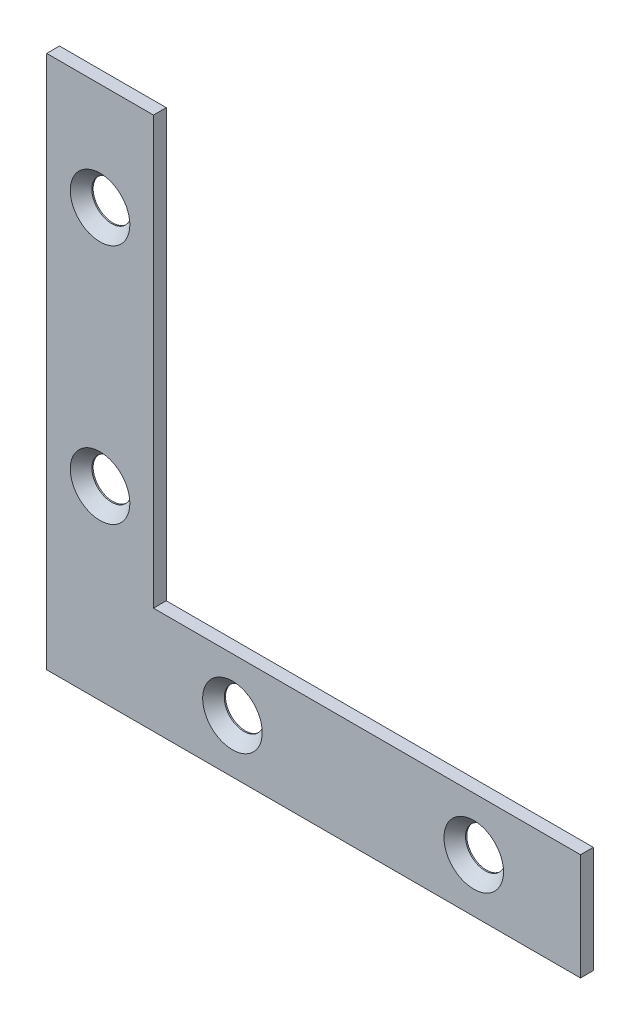
ISO-10303-21;
HEADER;
FILE_DESCRIPTION(('STEP AP214'),'2;1');
FILE_NAME('part.step','',(''),(''),'','','');
FILE_SCHEMA(('AUTOMOTIVE_DESIGN { 1 0 10303 214 1 1 1 1 }'));
ENDSEC;
DATA;
#1=APPLICATION_CONTEXT('core data for automotive mechanical design processes');
#2=APPLICATION_PROTOCOL_DEFINITION('international standard','automotive_design',2000,#1);
#3=PRODUCT_CONTEXT('',#1,'mechanical');
#4=PRODUCT('Part','Part','',(#3));
#5=PRODUCT_RELATED_PRODUCT_CATEGORY('part','',(#4));
#6=PRODUCT_DEFINITION_FORMATION('','',#4);
#7=PRODUCT_DEFINITION_CONTEXT('part definition',#1,'design');
#8=PRODUCT_DEFINITION('design','',#6,#7);
#9=PRODUCT_DEFINITION_SHAPE('','',#8);
#10=(LENGTH_UNIT() NAMED_UNIT(*) SI_UNIT(.MILLI.,.METRE.));
#11=(NAMED_UNIT(*) PLANE_ANGLE_UNIT() SI_UNIT($,.RADIAN.));
#12=(NAMED_UNIT(*) SI_UNIT($,.STERADIAN.) SOLID_ANGLE_UNIT());
#13=UNCERTAINTY_MEASURE_WITH_UNIT(LENGTH_MEASURE(1.E-05),#10,'distance_accuracy_value','');
#14=(GEOMETRIC_REPRESENTATION_CONTEXT(3) GLOBAL_UNCERTAINTY_ASSIGNED_CONTEXT((#13)) GLOBAL_UNIT_ASSIGNED_CONTEXT((#10,
#11,#12)) REPRESENTATION_CONTEXT('',''));
#15=CARTESIAN_POINT('',(0.,0.,0.));
#16=DIRECTION('',(0.,0.,1.));
#17=DIRECTION('',(1.,0.,0.));
#18=AXIS2_PLACEMENT_3D('',#15,#16,#17);
#19=CARTESIAN_POINT('',(-31.75,-31.75,0.762));
#20=DIRECTION('',(1.,0.,0.));
#21=DIRECTION('',(0.,1.,0.));
#22=AXIS2_PLACEMENT_3D('',#19,#20,#21);
#23=PLANE('',#22);
#24=DIRECTION('',(0.,0.,-1.));
#25=VECTOR('',#24,1.);
#26=CARTESIAN_POINT('',(-31.75,31.75,0.762));
#27=LINE('',#26,#25);
#28=CARTESIAN_POINT('',(-31.75,31.75,0.762));
#29=VERTEX_POINT('',#28);
#30=CARTESIAN_POINT('',(-31.75,31.75,-0.762));
#31=VERTEX_POINT('',#30);
#32=EDGE_CURVE('E109',#29,#31,#27,.T.);
#33=ORIENTED_EDGE('',*,*,#32,.T.);
#34=DIRECTION('',(0.,-1.,0.));
#35=VECTOR('',#34,1.);
#36=CARTESIAN_POINT('',(-31.75,-31.75,-0.762));
#37=LINE('',#36,#35);
#38=CARTESIAN_POINT('',(-31.75,-31.75,-0.762));
#39=VERTEX_POINT('',#38);
#40=EDGE_CURVE('E103',#31,#39,#37,.T.);
#41=ORIENTED_EDGE('',*,*,#40,.T.);
#42=DIRECTION('',(0.,0.,-1.));
#43=VECTOR('',#42,1.);
#44=CARTESIAN_POINT('',(-31.75,-31.75,0.762));
#45=LINE('',#44,#43);
#46=CARTESIAN_POINT('',(-31.75,-31.75,0.762));
#47=VERTEX_POINT('',#46);
#48=EDGE_CURVE('E11',#47,#39,#45,.T.);
#49=ORIENTED_EDGE('',*,*,#48,.F.);
#50=DIRECTION('',(0.,-1.,0.));
#51=VECTOR('',#50,1.);
#52=CARTESIAN_POINT('',(-31.75,-31.75,0.762));
#53=LINE('',#52,#51);
#54=EDGE_CURVE('E128',#29,#47,#53,.T.);
#55=ORIENTED_EDGE('',*,*,#54,.F.);
#56=EDGE_LOOP('',(#33,#41,#49,#55));
#57=FACE_BOUND('',#56,.T.);
#58=ADVANCED_FACE('F37',(#57),#23,.F.);
#59=CARTESIAN_POINT('',(31.75,-31.75,0.762));
#60=DIRECTION('',(0.,1.,0.));
#61=DIRECTION('',(0.,0.,1.));
#62=AXIS2_PLACEMENT_3D('',#59,#60,#61);
#63=PLANE('',#62);
#64=ORIENTED_EDGE('',*,*,#48,.T.);
#65=DIRECTION('',(1.,0.,0.));
#66=VECTOR('',#65,1.);
#67=CARTESIAN_POINT('',(31.75,-31.75,-0.762));
#68=LINE('',#67,#66);
#69=CARTESIAN_POINT('',(31.75,-31.75,-0.762));
#70=VERTEX_POINT('',#69);
#71=EDGE_CURVE('E93',#39,#70,#68,.T.);
#72=ORIENTED_EDGE('',*,*,#71,.T.);
#73=DIRECTION('',(0.,0.,-1.));
#74=VECTOR('',#73,1.);
#75=CARTESIAN_POINT('',(31.75,-31.75,0.762));
#76=LINE('',#75,#74);
#77=CARTESIAN_POINT('',(31.75,-31.75,0.762));
#78=VERTEX_POINT('',#77);
#79=EDGE_CURVE('E45',#78,#70,#76,.T.);
#80=ORIENTED_EDGE('',*,*,#79,.F.);
#81=DIRECTION('',(1.,0.,0.));
#82=VECTOR('',#81,1.);
#83=CARTESIAN_POINT('',(31.75,-31.75,0.762));
#84=LINE('',#83,#82);
#85=EDGE_CURVE('E94',#47,#78,#84,.T.);
#86=ORIENTED_EDGE('',*,*,#85,.F.);
#87=EDGE_LOOP('',(#64,#72,#80,#86));
#88=FACE_BOUND('',#87,.T.);
#89=ADVANCED_FACE('F91',(#88),#63,.F.);
#90=CARTESIAN_POINT('',(31.75,-19.05,0.762));
#91=DIRECTION('',(-1.,0.,0.));
#92=DIRECTION('',(0.,0.,1.));
#93=AXIS2_PLACEMENT_3D('',#90,#91,#92);
#94=PLANE('',#93);
#95=ORIENTED_EDGE('',*,*,#79,.T.);
#96=DIRECTION('',(0.,1.,0.));
#97=VECTOR('',#96,1.);
#98=CARTESIAN_POINT('',(31.75,-19.05,-0.762));
#99=LINE('',#98,#97);
#100=CARTESIAN_POINT('',(31.75,-19.05,-0.762));
#101=VERTEX_POINT('',#100);
#102=EDGE_CURVE('E107',#70,#101,#99,.T.);
#103=ORIENTED_EDGE('',*,*,#102,.T.);
#104=DIRECTION('',(0.,0.,-1.));
#105=VECTOR('',#104,1.);
#106=CARTESIAN_POINT('',(31.75,-19.05,0.762));
#107=LINE('',#106,#105);
#108=CARTESIAN_POINT('',(31.75,-19.05,0.762));
#109=VERTEX_POINT('',#108);
#110=EDGE_CURVE('E142',#109,#101,#107,.T.);
#111=ORIENTED_EDGE('',*,*,#110,.F.);
#112=DIRECTION('',(0.,1.,0.));
#113=VECTOR('',#112,1.);
#114=CARTESIAN_POINT('',(31.75,-19.05,0.762));
#115=LINE('',#114,#113);
#116=EDGE_CURVE('E131',#78,#109,#115,.T.);
#117=ORIENTED_EDGE('',*,*,#116,.F.);
#118=EDGE_LOOP('',(#95,#103,#111,#117));
#119=FACE_BOUND('',#118,.T.);
#120=ADVANCED_FACE('F196',(#119),#94,.F.);
#121=CARTESIAN_POINT('',(-19.05,-19.05,0.762));
#122=DIRECTION('',(0.,-1.,0.));
#123=DIRECTION('',(1.,0.,0.));
#124=AXIS2_PLACEMENT_3D('',#121,#122,#123);
#125=PLANE('',#124);
#126=ORIENTED_EDGE('',*,*,#110,.T.);
#127=DIRECTION('',(-1.,0.,0.));
#128=VECTOR('',#127,1.);
#129=CARTESIAN_POINT('',(-19.05,-19.05,-0.762));
#130=LINE('',#129,#128);
#131=CARTESIAN_POINT('',(-19.05,-19.05,-0.762));
#132=VERTEX_POINT('',#131);
#133=EDGE_CURVE('E120',#101,#132,#130,.T.);
#134=ORIENTED_EDGE('',*,*,#133,.T.);
#135=DIRECTION('',(0.,0.,-1.));
#136=VECTOR('',#135,1.);
#137=CARTESIAN_POINT('',(-19.05,-19.05,0.762));
#138=LINE('',#137,#136);
#139=CARTESIAN_POINT('',(-19.05,-19.05,0.762));
#140=VERTEX_POINT('',#139);
#141=EDGE_CURVE('E140',#140,#132,#138,.T.);
#142=ORIENTED_EDGE('',*,*,#141,.F.);
#143=DIRECTION('',(-1.,0.,0.));
#144=VECTOR('',#143,1.);
#145=CARTESIAN_POINT('',(-19.05,-19.05,0.762));
#146=LINE('',#145,#144);
#147=EDGE_CURVE('E133',#109,#140,#146,.T.);
#148=ORIENTED_EDGE('',*,*,#147,.F.);
#149=EDGE_LOOP('',(#126,#134,#142,#148));
#150=FACE_BOUND('',#149,.T.);
#151=ADVANCED_FACE('F200',(#150),#125,.F.);
#152=CARTESIAN_POINT('',(-19.05,31.75,0.762));
#153=DIRECTION('',(-1.,0.,0.));
#154=DIRECTION('',(0.,-1.,0.));
#155=AXIS2_PLACEMENT_3D('',#152,#153,#154);
#156=PLANE('',#155);
#157=ORIENTED_EDGE('',*,*,#141,.T.);
#158=DIRECTION('',(0.,1.,0.));
#159=VECTOR('',#158,1.);
#160=CARTESIAN_POINT('',(-19.05,31.75,-0.762));
#161=LINE('',#160,#159);
#162=CARTESIAN_POINT('',(-19.05,31.75,-0.762));
#163=VERTEX_POINT('',#162);
#164=EDGE_CURVE('E123',#132,#163,#161,.T.);
#165=ORIENTED_EDGE('',*,*,#164,.T.);
#166=DIRECTION('',(0.,0.,-1.));
#167=VECTOR('',#166,1.);
#168=CARTESIAN_POINT('',(-19.05,31.75,0.762));
#169=LINE('',#168,#167);
#170=CARTESIAN_POINT('',(-19.05,31.75,0.762));
#171=VERTEX_POINT('',#170);
#172=EDGE_CURVE('E138',#171,#163,#169,.T.);
#173=ORIENTED_EDGE('',*,*,#172,.F.);
#174=DIRECTION('',(0.,1.,0.));
#175=VECTOR('',#174,1.);
#176=CARTESIAN_POINT('',(-19.05,31.75,0.762));
#177=LINE('',#176,#175);
#178=EDGE_CURVE('E58',#140,#171,#177,.T.);
#179=ORIENTED_EDGE('',*,*,#178,.F.);
#180=EDGE_LOOP('',(#157,#165,#173,#179));
#181=FACE_BOUND('',#180,.T.);
#182=ADVANCED_FACE('F203',(#181),#156,.F.);
#183=CARTESIAN_POINT('',(-31.75,31.75,0.762));
#184=DIRECTION('',(0.,-1.,0.));
#185=DIRECTION('',(1.,0.,0.));
#186=AXIS2_PLACEMENT_3D('',#183,#184,#185);
#187=PLANE('',#186);
#188=ORIENTED_EDGE('',*,*,#172,.T.);
#189=DIRECTION('',(-1.,0.,0.));
#190=VECTOR('',#189,1.);
#191=CARTESIAN_POINT('',(-31.75,31.75,-0.762));
#192=LINE('',#191,#190);
#193=EDGE_CURVE('E126',#163,#31,#192,.T.);
#194=ORIENTED_EDGE('',*,*,#193,.T.);
#195=ORIENTED_EDGE('',*,*,#32,.F.);
#196=DIRECTION('',(-1.,0.,0.));
#197=VECTOR('',#196,1.);
#198=CARTESIAN_POINT('',(-31.75,31.75,0.762));
#199=LINE('',#198,#197);
#200=EDGE_CURVE('E53',#171,#29,#199,.T.);
#201=ORIENTED_EDGE('',*,*,#200,.F.);
#202=EDGE_LOOP('',(#188,#194,#195,#201));
#203=FACE_BOUND('',#202,.T.);
#204=ADVANCED_FACE('F186',(#203),#187,.F.);
#205=CARTESIAN_POINT('',(0.,0.,0.762));
#206=DIRECTION('',(0.,0.,-1.));
#207=DIRECTION('',(-1.,0.,0.));
#208=AXIS2_PLACEMENT_3D('',#205,#206,#207);
#209=PLANE('',#208);
#210=CARTESIAN_POINT('',(-25.4,19.05,0.762));
#211=DIRECTION('',(0.,0.,1.));
#212=DIRECTION('',(1.,0.,0.));
#213=AXIS2_PLACEMENT_3D('',#210,#211,#212);
#214=CIRCLE('',#213,3.5433);
#215=CARTESIAN_POINT('',(-21.8567,19.05,0.762));
#216=VERTEX_POINT('',#215);
#217=EDGE_CURVE('E149',#216,#216,#214,.T.);
#218=ORIENTED_EDGE('',*,*,#217,.F.);
#219=EDGE_LOOP('',(#218));
#220=FACE_BOUND('',#219,.T.);
#221=CARTESIAN_POINT('',(-25.4,-9.65199999999999,0.762));
#222=DIRECTION('',(0.,0.,1.));
#223=DIRECTION('',(1.,0.,0.));
#224=AXIS2_PLACEMENT_3D('',#221,#222,#223);
#225=CIRCLE('',#224,3.5433);
#226=CARTESIAN_POINT('',(-21.8567,-9.65199999999999,0.762));
#227=VERTEX_POINT('',#226);
#228=EDGE_CURVE('E174',#227,#227,#225,.T.);
#229=ORIENTED_EDGE('',*,*,#228,.F.);
#230=EDGE_LOOP('',(#229));
#231=FACE_BOUND('',#230,.T.);
#232=CARTESIAN_POINT('',(-9.65199999999999,-25.4,0.762));
#233=DIRECTION('',(0.,0.,1.));
#234=DIRECTION('',(1.,0.,0.));
#235=AXIS2_PLACEMENT_3D('',#232,#233,#234);
#236=CIRCLE('',#235,3.5433);
#237=CARTESIAN_POINT('',(-6.10869999999999,-25.4,0.762));
#238=VERTEX_POINT('',#237);
#239=EDGE_CURVE('E171',#238,#238,#236,.T.);
#240=ORIENTED_EDGE('',*,*,#239,.F.);
#241=EDGE_LOOP('',(#240));
#242=FACE_BOUND('',#241,.T.);
#243=CARTESIAN_POINT('',(19.05,-25.4,0.762));
#244=DIRECTION('',(0.,0.,1.));
#245=DIRECTION('',(1.,0.,0.));
#246=AXIS2_PLACEMENT_3D('',#243,#244,#245);
#247=CIRCLE('',#246,3.5433);
#248=CARTESIAN_POINT('',(22.5933,-25.4,0.762));
#249=VERTEX_POINT('',#248);
#250=EDGE_CURVE('E168',#249,#249,#247,.T.);
#251=ORIENTED_EDGE('',*,*,#250,.F.);
#252=EDGE_LOOP('',(#251));
#253=FACE_BOUND('',#252,.T.);
#254=ORIENTED_EDGE('',*,*,#54,.T.);
#255=ORIENTED_EDGE('',*,*,#85,.T.);
#256=ORIENTED_EDGE('',*,*,#116,.T.);
#257=ORIENTED_EDGE('',*,*,#147,.T.);
#258=ORIENTED_EDGE('',*,*,#178,.T.);
#259=ORIENTED_EDGE('',*,*,#200,.T.);
#260=EDGE_LOOP('',(#254,#255,#256,#257,#258,#259));
#261=FACE_BOUND('',#260,.T.);
#262=ADVANCED_FACE('F183',(#220,#231,#242,#253,#261),#209,.F.);
#263=CARTESIAN_POINT('',(0.,0.,-0.762));
#264=DIRECTION('',(0.,0.,-1.));
#265=DIRECTION('',(-1.,0.,0.));
#266=AXIS2_PLACEMENT_3D('',#263,#264,#265);
#267=PLANE('',#266);
#268=CARTESIAN_POINT('',(-25.4,19.05,-0.762));
#269=DIRECTION('',(0.,0.,1.));
#270=DIRECTION('',(1.,0.,0.));
#271=AXIS2_PLACEMENT_3D('',#268,#269,#270);
#272=CIRCLE('',#271,2.3495);
#273=CARTESIAN_POINT('',(-23.0505,19.05,-0.762));
#274=VERTEX_POINT('',#273);
#275=EDGE_CURVE('E110',#274,#274,#272,.T.);
#276=ORIENTED_EDGE('',*,*,#275,.T.);
#277=EDGE_LOOP('',(#276));
#278=FACE_BOUND('',#277,.T.);
#279=CARTESIAN_POINT('',(-25.4,-9.65199999999999,-0.762));
#280=DIRECTION('',(0.,0.,1.));
#281=DIRECTION('',(1.,0.,0.));
#282=AXIS2_PLACEMENT_3D('',#279,#280,#281);
#283=CIRCLE('',#282,2.3495);
#284=CARTESIAN_POINT('',(-23.0505,-9.65199999999999,-0.762));
#285=VERTEX_POINT('',#284);
#286=EDGE_CURVE('E113',#285,#285,#283,.T.);
#287=ORIENTED_EDGE('',*,*,#286,.T.);
#288=EDGE_LOOP('',(#287));
#289=FACE_BOUND('',#288,.T.);
#290=CARTESIAN_POINT('',(-9.65199999999999,-25.4,-0.762));
#291=DIRECTION('',(0.,0.,1.));
#292=DIRECTION('',(1.,0.,0.));
#293=AXIS2_PLACEMENT_3D('',#290,#291,#292);
#294=CIRCLE('',#293,2.3495);
#295=CARTESIAN_POINT('',(-7.30249999999999,-25.4,-0.762));
#296=VERTEX_POINT('',#295);
#297=EDGE_CURVE('E159',#296,#296,#294,.T.);
#298=ORIENTED_EDGE('',*,*,#297,.T.);
#299=EDGE_LOOP('',(#298));
#300=FACE_BOUND('',#299,.T.);
#301=CARTESIAN_POINT('',(19.05,-25.4,-0.762));
#302=DIRECTION('',(0.,0.,1.));
#303=DIRECTION('',(1.,0.,0.));
#304=AXIS2_PLACEMENT_3D('',#301,#302,#303);
#305=CIRCLE('',#304,2.3495);
#306=CARTESIAN_POINT('',(21.3995,-25.4,-0.762));
#307=VERTEX_POINT('',#306);
#308=EDGE_CURVE('E116',#307,#307,#305,.T.);
#309=ORIENTED_EDGE('',*,*,#308,.T.);
#310=EDGE_LOOP('',(#309));
#311=FACE_BOUND('',#310,.T.);
#312=ORIENTED_EDGE('',*,*,#40,.F.);
#313=ORIENTED_EDGE('',*,*,#193,.F.);
#314=ORIENTED_EDGE('',*,*,#164,.F.);
#315=ORIENTED_EDGE('',*,*,#133,.F.);
#316=ORIENTED_EDGE('',*,*,#102,.F.);
#317=ORIENTED_EDGE('',*,*,#71,.F.);
#318=EDGE_LOOP('',(#312,#313,#314,#315,#316,#317));
#319=FACE_BOUND('',#318,.T.);
#320=ADVANCED_FACE('F101',(#278,#289,#300,#311,#319),#267,.T.);
#321=CARTESIAN_POINT('',(19.05,-25.4,-0.762));
#322=DIRECTION('',(0.,0.,1.));
#323=DIRECTION('',(1.,0.,0.));
#324=AXIS2_PLACEMENT_3D('',#321,#322,#323);
#325=CYLINDRICAL_SURFACE('',#324,2.3495);
#326=CARTESIAN_POINT('',(19.05,-25.4,-0.611309804540436));
#327=DIRECTION('',(0.,0.,1.));
#328=DIRECTION('',(1.,0.,0.));
#329=AXIS2_PLACEMENT_3D('',#326,#327,#328);
#330=CIRCLE('',#329,2.3495);
#331=CARTESIAN_POINT('',(21.3995,-25.4,-0.611309804540436));
#332=VERTEX_POINT('',#331);
#333=EDGE_CURVE('E40',#332,#332,#330,.T.);
#334=ORIENTED_EDGE('',*,*,#333,.T.);
#335=EDGE_LOOP('',(#334));
#336=FACE_BOUND('',#335,.T.);
#337=ORIENTED_EDGE('',*,*,#308,.F.);
#338=EDGE_LOOP('',(#337));
#339=FACE_BOUND('',#338,.T.);
#340=ADVANCED_FACE('F243',(#336,#339),#325,.F.);
#341=CARTESIAN_POINT('',(-9.65199999999999,-25.4,-0.762));
#342=DIRECTION('',(0.,0.,1.));
#343=DIRECTION('',(1.,0.,0.));
#344=AXIS2_PLACEMENT_3D('',#341,#342,#343);
#345=CYLINDRICAL_SURFACE('',#344,2.3495);
#346=CARTESIAN_POINT('',(-9.65199999999999,-25.4,-0.61130980454044));
#347=DIRECTION('',(0.,0.,1.));
#348=DIRECTION('',(1.,0.,0.));
#349=AXIS2_PLACEMENT_3D('',#346,#347,#348);
#350=CIRCLE('',#349,2.3495);
#351=CARTESIAN_POINT('',(-7.30249999999999,-25.4,-0.61130980454044));
#352=VERTEX_POINT('',#351);
#353=EDGE_CURVE('E151',#352,#352,#350,.T.);
#354=ORIENTED_EDGE('',*,*,#353,.T.);
#355=EDGE_LOOP('',(#354));
#356=FACE_BOUND('',#355,.T.);
#357=ORIENTED_EDGE('',*,*,#297,.F.);
#358=EDGE_LOOP('',(#357));
#359=FACE_BOUND('',#358,.T.);
#360=ADVANCED_FACE('F250',(#356,#359),#345,.F.);
#361=CARTESIAN_POINT('',(-25.4,-9.65199999999999,-0.762));
#362=DIRECTION('',(0.,0.,1.));
#363=DIRECTION('',(1.,0.,0.));
#364=AXIS2_PLACEMENT_3D('',#361,#362,#363);
#365=CYLINDRICAL_SURFACE('',#364,2.3495);
#366=CARTESIAN_POINT('',(-25.4,-9.65199999999999,-0.611309804540441));
#367=DIRECTION('',(0.,0.,1.));
#368=DIRECTION('',(1.,0.,0.));
#369=AXIS2_PLACEMENT_3D('',#366,#367,#368);
#370=CIRCLE('',#369,2.3495);
#371=CARTESIAN_POINT('',(-23.0505,-9.65199999999999,-0.611309804540441));
#372=VERTEX_POINT('',#371);
#373=EDGE_CURVE('E148',#372,#372,#370,.T.);
#374=ORIENTED_EDGE('',*,*,#373,.T.);
#375=EDGE_LOOP('',(#374));
#376=FACE_BOUND('',#375,.T.);
#377=ORIENTED_EDGE('',*,*,#286,.F.);
#378=EDGE_LOOP('',(#377));
#379=FACE_BOUND('',#378,.T.);
#380=ADVANCED_FACE('F257',(#376,#379),#365,.F.);
#381=CARTESIAN_POINT('',(-25.4,19.05,-0.762));
#382=DIRECTION('',(0.,0.,1.));
#383=DIRECTION('',(1.,0.,0.));
#384=AXIS2_PLACEMENT_3D('',#381,#382,#383);
#385=CYLINDRICAL_SURFACE('',#384,2.3495);
#386=CARTESIAN_POINT('',(-25.4,19.05,-0.611309804540441));
#387=DIRECTION('',(0.,0.,1.));
#388=DIRECTION('',(1.,0.,0.));
#389=AXIS2_PLACEMENT_3D('',#386,#387,#388);
#390=CIRCLE('',#389,2.3495);
#391=CARTESIAN_POINT('',(-23.0505,19.05,-0.611309804540441));
#392=VERTEX_POINT('',#391);
#393=EDGE_CURVE('E145',#392,#392,#390,.T.);
#394=ORIENTED_EDGE('',*,*,#393,.T.);
#395=EDGE_LOOP('',(#394));
#396=FACE_BOUND('',#395,.T.);
#397=ORIENTED_EDGE('',*,*,#275,.F.);
#398=EDGE_LOOP('',(#397));
#399=FACE_BOUND('',#398,.T.);
#400=ADVANCED_FACE('F264',(#396,#399),#385,.F.);
#401=CARTESIAN_POINT('',(-25.4,19.05,0.762));
#402=DIRECTION('',(0.,0.,1.));
#403=DIRECTION('',(1.,0.,0.));
#404=AXIS2_PLACEMENT_3D('',#401,#402,#403);
#405=CONICAL_SURFACE('',#404,3.5433,0.715584993317677);
#406=ORIENTED_EDGE('',*,*,#217,.T.);
#407=EDGE_LOOP('',(#406));
#408=FACE_BOUND('',#407,.T.);
#409=ORIENTED_EDGE('',*,*,#393,.F.);
#410=EDGE_LOOP('',(#409));
#411=FACE_BOUND('',#410,.T.);
#412=ADVANCED_FACE('F180',(#408,#411),#405,.F.);
#413=CARTESIAN_POINT('',(-25.4,-9.65199999999999,0.762));
#414=DIRECTION('',(0.,0.,1.));
#415=DIRECTION('',(1.,0.,0.));
#416=AXIS2_PLACEMENT_3D('',#413,#414,#415);
#417=CONICAL_SURFACE('',#416,3.5433,0.715584993317677);
#418=ORIENTED_EDGE('',*,*,#228,.T.);
#419=EDGE_LOOP('',(#418));
#420=FACE_BOUND('',#419,.T.);
#421=ORIENTED_EDGE('',*,*,#373,.F.);
#422=EDGE_LOOP('',(#421));
#423=FACE_BOUND('',#422,.T.);
#424=ADVANCED_FACE('F279',(#420,#423),#417,.F.);
#425=CARTESIAN_POINT('',(-9.65199999999999,-25.4,0.762));
#426=DIRECTION('',(0.,0.,1.));
#427=DIRECTION('',(1.,0.,0.));
#428=AXIS2_PLACEMENT_3D('',#425,#426,#427);
#429=CONICAL_SURFACE('',#428,3.5433,0.715584993317677);
#430=ORIENTED_EDGE('',*,*,#239,.T.);
#431=EDGE_LOOP('',(#430));
#432=FACE_BOUND('',#431,.T.);
#433=ORIENTED_EDGE('',*,*,#353,.F.);
#434=EDGE_LOOP('',(#433));
#435=FACE_BOUND('',#434,.T.);
#436=ADVANCED_FACE('F286',(#432,#435),#429,.F.);
#437=CARTESIAN_POINT('',(19.05,-25.4,0.762));
#438=DIRECTION('',(0.,0.,1.));
#439=DIRECTION('',(1.,0.,0.));
#440=AXIS2_PLACEMENT_3D('',#437,#438,#439);
#441=CONICAL_SURFACE('',#440,3.5433,0.715584993317677);
#442=ORIENTED_EDGE('',*,*,#250,.T.);
#443=EDGE_LOOP('',(#442));
#444=FACE_BOUND('',#443,.T.);
#445=ORIENTED_EDGE('',*,*,#333,.F.);
#446=EDGE_LOOP('',(#445));
#447=FACE_BOUND('',#446,.T.);
#448=ADVANCED_FACE('F294',(#444,#447),#441,.F.);
#449=CLOSED_SHELL('',(#58,#89,#120,#151,#182,#204,#262,#320,#340,#360,#380,#400,#412,#424,#436,#448));
#450=MANIFOLD_SOLID_BREP('B2',#449);
#451=ADVANCED_BREP_SHAPE_REPRESENTATION('',(#18,#450),#14);
#452=SHAPE_DEFINITION_REPRESENTATION(#9,#451);
ENDSEC;
END-ISO-10303-21;
